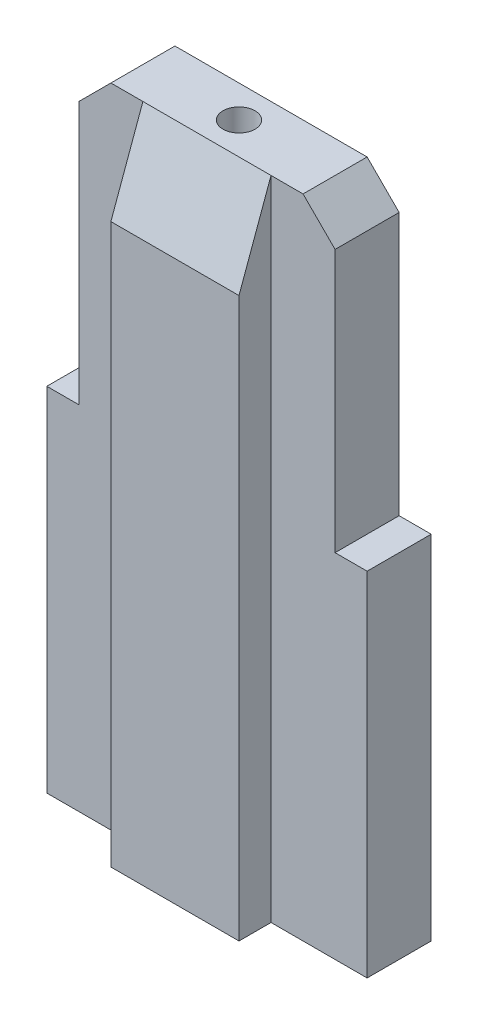
ISO-10303-21;
HEADER;
FILE_DESCRIPTION(('STEP AP214'),'2;1');
FILE_NAME('part.step','',(''),(''),'','','');
FILE_SCHEMA(('AUTOMOTIVE_DESIGN { 1 0 10303 214 1 1 1 1 }'));
ENDSEC;
DATA;
#1=APPLICATION_CONTEXT('core data for automotive mechanical design processes');
#2=APPLICATION_PROTOCOL_DEFINITION('international standard','automotive_design',2000,#1);
#3=PRODUCT_CONTEXT('',#1,'mechanical');
#4=PRODUCT('Part','Part','',(#3));
#5=PRODUCT_RELATED_PRODUCT_CATEGORY('part','',(#4));
#6=PRODUCT_DEFINITION_FORMATION('','',#4);
#7=PRODUCT_DEFINITION_CONTEXT('part definition',#1,'design');
#8=PRODUCT_DEFINITION('design','',#6,#7);
#9=PRODUCT_DEFINITION_SHAPE('','',#8);
#10=(LENGTH_UNIT() NAMED_UNIT(*) SI_UNIT(.MILLI.,.METRE.));
#11=(NAMED_UNIT(*) PLANE_ANGLE_UNIT() SI_UNIT($,.RADIAN.));
#12=(NAMED_UNIT(*) SI_UNIT($,.STERADIAN.) SOLID_ANGLE_UNIT());
#13=UNCERTAINTY_MEASURE_WITH_UNIT(LENGTH_MEASURE(1.E-05),#10,'distance_accuracy_value','');
#14=(GEOMETRIC_REPRESENTATION_CONTEXT(3) GLOBAL_UNCERTAINTY_ASSIGNED_CONTEXT((#13)) GLOBAL_UNIT_ASSIGNED_CONTEXT((#10,
#11,#12)) REPRESENTATION_CONTEXT('',''));
#15=CARTESIAN_POINT('',(0.,0.,0.));
#16=DIRECTION('',(0.,0.,1.));
#17=DIRECTION('',(1.,0.,0.));
#18=AXIS2_PLACEMENT_3D('',#15,#16,#17);
#19=CARTESIAN_POINT('',(0.,0.,-0.5));
#20=DIRECTION('',(0.,0.,1.));
#21=DIRECTION('',(1.,0.,0.));
#22=AXIS2_PLACEMENT_3D('',#19,#20,#21);
#23=PLANE('',#22);
#24=DIRECTION('',(0.,-1.,0.));
#25=VECTOR('',#24,1.);
#26=CARTESIAN_POINT('',(-2.,2.75,-0.5));
#27=LINE('',#26,#25);
#28=CARTESIAN_POINT('',(-2.,6.85,-0.5));
#29=VERTEX_POINT('',#28);
#30=CARTESIAN_POINT('',(-2.,2.75,-0.5));
#31=VERTEX_POINT('',#30);
#32=EDGE_CURVE('E268',#29,#31,#27,.T.);
#33=ORIENTED_EDGE('',*,*,#32,.F.);
#34=DIRECTION('',(-0.707106781186549,-0.707106781186546,0.));
#35=VECTOR('',#34,1.);
#36=CARTESIAN_POINT('',(-2.,6.85,-0.5));
#37=LINE('',#36,#35);
#38=CARTESIAN_POINT('',(-1.49999999999999,7.35,-0.5));
#39=VERTEX_POINT('',#38);
#40=EDGE_CURVE('E219',#29,#39,#37,.F.);
#41=ORIENTED_EDGE('',*,*,#40,.T.);
#42=DIRECTION('',(-1.,0.,0.));
#43=VECTOR('',#42,1.);
#44=CARTESIAN_POINT('',(-2.,7.35,-0.5));
#45=LINE('',#44,#43);
#46=CARTESIAN_POINT('',(-1.,7.35,-0.5));
#47=VERTEX_POINT('',#46);
#48=EDGE_CURVE('E265',#47,#39,#45,.T.);
#49=ORIENTED_EDGE('',*,*,#48,.F.);
#50=DIRECTION('',(0.,1.,0.));
#51=VECTOR('',#50,1.);
#52=CARTESIAN_POINT('',(-1.,7.35,-0.5));
#53=LINE('',#52,#51);
#54=CARTESIAN_POINT('',(-1.,-2.75,-0.5));
#55=VERTEX_POINT('',#54);
#56=EDGE_CURVE('E195',#55,#47,#53,.T.);
#57=ORIENTED_EDGE('',*,*,#56,.F.);
#58=DIRECTION('',(1.,0.,0.));
#59=VECTOR('',#58,1.);
#60=CARTESIAN_POINT('',(-2.5,-2.75,-0.5));
#61=LINE('',#60,#59);
#62=CARTESIAN_POINT('',(-2.5,-2.75,-0.5));
#63=VERTEX_POINT('',#62);
#64=EDGE_CURVE('E382',#63,#55,#61,.T.);
#65=ORIENTED_EDGE('',*,*,#64,.F.);
#66=DIRECTION('',(0.,-1.,0.));
#67=VECTOR('',#66,1.);
#68=CARTESIAN_POINT('',(-2.5,2.75,-0.5));
#69=LINE('',#68,#67);
#70=CARTESIAN_POINT('',(-2.5,2.75,-0.5));
#71=VERTEX_POINT('',#70);
#72=EDGE_CURVE('E419',#71,#63,#69,.T.);
#73=ORIENTED_EDGE('',*,*,#72,.F.);
#74=DIRECTION('',(-1.,0.,0.));
#75=VECTOR('',#74,1.);
#76=CARTESIAN_POINT('',(-2.5,2.75,-0.5));
#77=LINE('',#76,#75);
#78=EDGE_CURVE('E438',#31,#71,#77,.T.);
#79=ORIENTED_EDGE('',*,*,#78,.F.);
#80=EDGE_LOOP('',(#33,#41,#49,#57,#65,#73,#79));
#81=FACE_BOUND('',#80,.T.);
#82=ADVANCED_FACE('F33',(#81),#23,.F.);
#83=CARTESIAN_POINT('',(1.5,7.35,-0.5));
#84=VERTEX_POINT('',#83);
#85=CARTESIAN_POINT('',(0.999999999999999,7.35,-0.5));
#86=VERTEX_POINT('',#85);
#87=EDGE_CURVE('E231',#84,#86,#45,.T.);
#88=ORIENTED_EDGE('',*,*,#87,.F.);
#89=DIRECTION('',(-0.707106781186546,0.707106781186549,0.));
#90=VECTOR('',#89,1.);
#91=CARTESIAN_POINT('',(1.5,7.35,-0.5));
#92=LINE('',#91,#90);
#93=CARTESIAN_POINT('',(2.,6.85,-0.5));
#94=VERTEX_POINT('',#93);
#95=EDGE_CURVE('E56',#84,#94,#92,.F.);
#96=ORIENTED_EDGE('',*,*,#95,.T.);
#97=DIRECTION('',(0.,1.,0.));
#98=VECTOR('',#97,1.);
#99=CARTESIAN_POINT('',(2.,7.35,-0.5));
#100=LINE('',#99,#98);
#101=CARTESIAN_POINT('',(2.,2.75,-0.5));
#102=VERTEX_POINT('',#101);
#103=EDGE_CURVE('E264',#102,#94,#100,.T.);
#104=ORIENTED_EDGE('',*,*,#103,.F.);
#105=DIRECTION('',(-1.,0.,0.));
#106=VECTOR('',#105,1.);
#107=CARTESIAN_POINT('',(2.,2.75,-0.5));
#108=LINE('',#107,#106);
#109=CARTESIAN_POINT('',(2.5,2.75,-0.5));
#110=VERTEX_POINT('',#109);
#111=EDGE_CURVE('E261',#110,#102,#108,.T.);
#112=ORIENTED_EDGE('',*,*,#111,.F.);
#113=DIRECTION('',(0.,1.,0.));
#114=VECTOR('',#113,1.);
#115=CARTESIAN_POINT('',(2.5,2.75,-0.5));
#116=LINE('',#115,#114);
#117=CARTESIAN_POINT('',(2.5,-2.75,-0.5));
#118=VERTEX_POINT('',#117);
#119=EDGE_CURVE('E257',#118,#110,#116,.T.);
#120=ORIENTED_EDGE('',*,*,#119,.F.);
#121=CARTESIAN_POINT('',(0.999999999999999,-2.75,-0.5));
#122=VERTEX_POINT('',#121);
#123=EDGE_CURVE('E275',#122,#118,#61,.T.);
#124=ORIENTED_EDGE('',*,*,#123,.F.);
#125=DIRECTION('',(0.,-1.,0.));
#126=VECTOR('',#125,1.);
#127=CARTESIAN_POINT('',(1.,7.35,-0.5));
#128=LINE('',#127,#126);
#129=EDGE_CURVE('E177',#86,#122,#128,.T.);
#130=ORIENTED_EDGE('',*,*,#129,.F.);
#131=EDGE_LOOP('',(#88,#96,#104,#112,#120,#124,#130));
#132=FACE_BOUND('',#131,.T.);
#133=ADVANCED_FACE('F297',(#132),#23,.F.);
#134=CARTESIAN_POINT('',(0.,0.,0.5));
#135=DIRECTION('',(0.,0.,1.));
#136=DIRECTION('',(1.,0.,0.));
#137=AXIS2_PLACEMENT_3D('',#134,#135,#136);
#138=PLANE('',#137);
#139=DIRECTION('',(0.,1.,0.));
#140=VECTOR('',#139,1.);
#141=CARTESIAN_POINT('',(2.,7.35,0.5));
#142=LINE('',#141,#140);
#143=CARTESIAN_POINT('',(2.,2.75,0.5));
#144=VERTEX_POINT('',#143);
#145=CARTESIAN_POINT('',(2.,6.85,0.5));
#146=VERTEX_POINT('',#145);
#147=EDGE_CURVE('E237',#144,#146,#142,.T.);
#148=ORIENTED_EDGE('',*,*,#147,.T.);
#149=DIRECTION('',(0.707106781186546,-0.707106781186549,0.));
#150=VECTOR('',#149,1.);
#151=CARTESIAN_POINT('',(4.425,4.42499999999999,0.5));
#152=LINE('',#151,#150);
#153=CARTESIAN_POINT('',(1.5,7.35,0.5));
#154=VERTEX_POINT('',#153);
#155=EDGE_CURVE('E11',#146,#154,#152,.F.);
#156=ORIENTED_EDGE('',*,*,#155,.T.);
#157=DIRECTION('',(-1.,0.,0.));
#158=VECTOR('',#157,1.);
#159=CARTESIAN_POINT('',(-2.,7.35,0.5));
#160=LINE('',#159,#158);
#161=CARTESIAN_POINT('',(1.,7.35,0.5));
#162=VERTEX_POINT('',#161);
#163=EDGE_CURVE('E226',#154,#162,#160,.T.);
#164=ORIENTED_EDGE('',*,*,#163,.T.);
#165=DIRECTION('',(0.,1.,0.));
#166=VECTOR('',#165,1.);
#167=CARTESIAN_POINT('',(1.,7.35,0.5));
#168=LINE('',#167,#166);
#169=CARTESIAN_POINT('',(1.,-2.75,0.5));
#170=VERTEX_POINT('',#169);
#171=EDGE_CURVE('E179',#170,#162,#168,.T.);
#172=ORIENTED_EDGE('',*,*,#171,.F.);
#173=DIRECTION('',(1.,0.,0.));
#174=VECTOR('',#173,1.);
#175=CARTESIAN_POINT('',(-2.5,-2.75,0.5));
#176=LINE('',#175,#174);
#177=CARTESIAN_POINT('',(2.5,-2.75,0.5));
#178=VERTEX_POINT('',#177);
#179=EDGE_CURVE('E251',#170,#178,#176,.T.);
#180=ORIENTED_EDGE('',*,*,#179,.T.);
#181=DIRECTION('',(0.,1.,0.));
#182=VECTOR('',#181,1.);
#183=CARTESIAN_POINT('',(2.5,2.75,0.5));
#184=LINE('',#183,#182);
#185=CARTESIAN_POINT('',(2.5,2.75,0.5));
#186=VERTEX_POINT('',#185);
#187=EDGE_CURVE('E371',#178,#186,#184,.T.);
#188=ORIENTED_EDGE('',*,*,#187,.T.);
#189=DIRECTION('',(-1.,0.,0.));
#190=VECTOR('',#189,1.);
#191=CARTESIAN_POINT('',(2.,2.75,0.5));
#192=LINE('',#191,#190);
#193=EDGE_CURVE('E381',#186,#144,#192,.T.);
#194=ORIENTED_EDGE('',*,*,#193,.T.);
#195=EDGE_LOOP('',(#148,#156,#164,#172,#180,#188,#194));
#196=FACE_BOUND('',#195,.T.);
#197=ADVANCED_FACE('F303',(#196),#138,.T.);
#198=CARTESIAN_POINT('',(2.5,2.75,0.5));
#199=DIRECTION('',(-1.,0.,0.));
#200=DIRECTION('',(0.,-1.,0.));
#201=AXIS2_PLACEMENT_3D('',#198,#199,#200);
#202=PLANE('',#201);
#203=ORIENTED_EDGE('',*,*,#119,.T.);
#204=DIRECTION('',(0.,0.,-1.));
#205=VECTOR('',#204,1.);
#206=CARTESIAN_POINT('',(2.5,2.75,0.5));
#207=LINE('',#206,#205);
#208=EDGE_CURVE('E245',#186,#110,#207,.T.);
#209=ORIENTED_EDGE('',*,*,#208,.F.);
#210=ORIENTED_EDGE('',*,*,#187,.F.);
#211=DIRECTION('',(0.,0.,-1.));
#212=VECTOR('',#211,1.);
#213=CARTESIAN_POINT('',(2.5,-2.75,0.5));
#214=LINE('',#213,#212);
#215=EDGE_CURVE('E250',#178,#118,#214,.T.);
#216=ORIENTED_EDGE('',*,*,#215,.T.);
#217=EDGE_LOOP('',(#203,#209,#210,#216));
#218=FACE_BOUND('',#217,.T.);
#219=ADVANCED_FACE('F333',(#218),#202,.F.);
#220=CARTESIAN_POINT('',(2.,2.75,0.5));
#221=DIRECTION('',(0.,-1.,0.));
#222=DIRECTION('',(0.,0.,-1.));
#223=AXIS2_PLACEMENT_3D('',#220,#221,#222);
#224=PLANE('',#223);
#225=ORIENTED_EDGE('',*,*,#111,.T.);
#226=DIRECTION('',(0.,0.,-1.));
#227=VECTOR('',#226,1.);
#228=CARTESIAN_POINT('',(2.,2.75,0.5));
#229=LINE('',#228,#227);
#230=EDGE_CURVE('E427',#144,#102,#229,.T.);
#231=ORIENTED_EDGE('',*,*,#230,.F.);
#232=ORIENTED_EDGE('',*,*,#193,.F.);
#233=ORIENTED_EDGE('',*,*,#208,.T.);
#234=EDGE_LOOP('',(#225,#231,#232,#233));
#235=FACE_BOUND('',#234,.T.);
#236=ADVANCED_FACE('F330',(#235),#224,.F.);
#237=CARTESIAN_POINT('',(2.,7.35,0.5));
#238=DIRECTION('',(-1.,0.,0.));
#239=DIRECTION('',(0.,-1.,0.));
#240=AXIS2_PLACEMENT_3D('',#237,#238,#239);
#241=PLANE('',#240);
#242=ORIENTED_EDGE('',*,*,#103,.T.);
#243=DIRECTION('',(0.,0.,1.));
#244=VECTOR('',#243,1.);
#245=CARTESIAN_POINT('',(2.,6.85,0.5));
#246=LINE('',#245,#244);
#247=EDGE_CURVE('E42',#94,#146,#246,.T.);
#248=ORIENTED_EDGE('',*,*,#247,.T.);
#249=ORIENTED_EDGE('',*,*,#147,.F.);
#250=ORIENTED_EDGE('',*,*,#230,.T.);
#251=EDGE_LOOP('',(#242,#248,#249,#250));
#252=FACE_BOUND('',#251,.T.);
#253=ADVANCED_FACE('F326',(#252),#241,.F.);
#254=CARTESIAN_POINT('',(-2.,7.35,0.5));
#255=DIRECTION('',(0.,-1.,0.));
#256=DIRECTION('',(0.,0.,-1.));
#257=AXIS2_PLACEMENT_3D('',#254,#255,#256);
#258=PLANE('',#257);
#259=CARTESIAN_POINT('',(0.,7.35,0.));
#260=DIRECTION('',(0.,1.,0.));
#261=DIRECTION('',(0.,0.,1.));
#262=AXIS2_PLACEMENT_3D('',#259,#260,#261);
#263=CIRCLE('',#262,0.25);
#264=CARTESIAN_POINT('',(0.,7.35,0.25));
#265=VERTEX_POINT('',#264);
#266=EDGE_CURVE('E279',#265,#265,#263,.T.);
#267=ORIENTED_EDGE('',*,*,#266,.F.);
#268=EDGE_LOOP('',(#267));
#269=FACE_BOUND('',#268,.T.);
#270=ORIENTED_EDGE('',*,*,#163,.F.);
#271=DIRECTION('',(0.,0.,-1.));
#272=VECTOR('',#271,1.);
#273=CARTESIAN_POINT('',(1.5,7.35,0.5));
#274=LINE('',#273,#272);
#275=EDGE_CURVE('E225',#154,#84,#274,.T.);
#276=ORIENTED_EDGE('',*,*,#275,.T.);
#277=ORIENTED_EDGE('',*,*,#87,.T.);
#278=DIRECTION('',(-1.,0.,0.));
#279=VECTOR('',#278,1.);
#280=CARTESIAN_POINT('',(-1.,7.35,-0.5));
#281=LINE('',#280,#279);
#282=EDGE_CURVE('E206',#86,#47,#281,.T.);
#283=ORIENTED_EDGE('',*,*,#282,.T.);
#284=ORIENTED_EDGE('',*,*,#48,.T.);
#285=DIRECTION('',(0.,0.,1.));
#286=VECTOR('',#285,1.);
#287=CARTESIAN_POINT('',(-1.49999999999999,7.35,0.5));
#288=LINE('',#287,#286);
#289=CARTESIAN_POINT('',(-1.49999999999999,7.35,0.5));
#290=VERTEX_POINT('',#289);
#291=EDGE_CURVE('E221',#39,#290,#288,.T.);
#292=ORIENTED_EDGE('',*,*,#291,.T.);
#293=CARTESIAN_POINT('',(-0.999999999999999,7.35,0.5));
#294=VERTEX_POINT('',#293);
#295=EDGE_CURVE('E230',#294,#290,#160,.T.);
#296=ORIENTED_EDGE('',*,*,#295,.F.);
#297=DIRECTION('',(1.,0.,0.));
#298=VECTOR('',#297,1.);
#299=CARTESIAN_POINT('',(1.,7.35,0.5));
#300=LINE('',#299,#298);
#301=EDGE_CURVE('E408',#294,#162,#300,.T.);
#302=ORIENTED_EDGE('',*,*,#301,.T.);
#303=EDGE_LOOP('',(#270,#276,#277,#283,#284,#292,#296,#302));
#304=FACE_BOUND('',#303,.T.);
#305=ADVANCED_FACE('F322',(#269,#304),#258,.F.);
#306=CARTESIAN_POINT('',(-2.,2.75,0.5));
#307=DIRECTION('',(1.,0.,0.));
#308=DIRECTION('',(0.,0.,-1.));
#309=AXIS2_PLACEMENT_3D('',#306,#307,#308);
#310=PLANE('',#309);
#311=DIRECTION('',(0.,-1.,0.));
#312=VECTOR('',#311,1.);
#313=CARTESIAN_POINT('',(-2.,2.75,0.5));
#314=LINE('',#313,#312);
#315=CARTESIAN_POINT('',(-2.,6.85,0.5));
#316=VERTEX_POINT('',#315);
#317=CARTESIAN_POINT('',(-2.,2.75,0.5));
#318=VERTEX_POINT('',#317);
#319=EDGE_CURVE('E229',#316,#318,#314,.T.);
#320=ORIENTED_EDGE('',*,*,#319,.F.);
#321=DIRECTION('',(0.,0.,-1.));
#322=VECTOR('',#321,1.);
#323=CARTESIAN_POINT('',(-2.,6.85,0.5));
#324=LINE('',#323,#322);
#325=EDGE_CURVE('E214',#316,#29,#324,.T.);
#326=ORIENTED_EDGE('',*,*,#325,.T.);
#327=ORIENTED_EDGE('',*,*,#32,.T.);
#328=DIRECTION('',(0.,0.,-1.));
#329=VECTOR('',#328,1.);
#330=CARTESIAN_POINT('',(-2.,2.75,0.5));
#331=LINE('',#330,#329);
#332=EDGE_CURVE('E360',#318,#31,#331,.T.);
#333=ORIENTED_EDGE('',*,*,#332,.F.);
#334=EDGE_LOOP('',(#320,#326,#327,#333));
#335=FACE_BOUND('',#334,.T.);
#336=ADVANCED_FACE('F318',(#335),#310,.F.);
#337=CARTESIAN_POINT('',(-2.5,2.75,0.5));
#338=DIRECTION('',(0.,-1.,0.));
#339=DIRECTION('',(0.,0.,-1.));
#340=AXIS2_PLACEMENT_3D('',#337,#338,#339);
#341=PLANE('',#340);
#342=ORIENTED_EDGE('',*,*,#78,.T.);
#343=DIRECTION('',(0.,0.,-1.));
#344=VECTOR('',#343,1.);
#345=CARTESIAN_POINT('',(-2.5,2.75,0.5));
#346=LINE('',#345,#344);
#347=CARTESIAN_POINT('',(-2.5,2.75,0.5));
#348=VERTEX_POINT('',#347);
#349=EDGE_CURVE('E424',#348,#71,#346,.T.);
#350=ORIENTED_EDGE('',*,*,#349,.F.);
#351=DIRECTION('',(-1.,0.,0.));
#352=VECTOR('',#351,1.);
#353=CARTESIAN_POINT('',(-2.5,2.75,0.5));
#354=LINE('',#353,#352);
#355=EDGE_CURVE('E362',#318,#348,#354,.T.);
#356=ORIENTED_EDGE('',*,*,#355,.F.);
#357=ORIENTED_EDGE('',*,*,#332,.T.);
#358=EDGE_LOOP('',(#342,#350,#356,#357));
#359=FACE_BOUND('',#358,.T.);
#360=ADVANCED_FACE('F314',(#359),#341,.F.);
#361=CARTESIAN_POINT('',(-2.5,2.75,0.5));
#362=DIRECTION('',(1.,0.,0.));
#363=DIRECTION('',(0.,1.,0.));
#364=AXIS2_PLACEMENT_3D('',#361,#362,#363);
#365=PLANE('',#364);
#366=ORIENTED_EDGE('',*,*,#72,.T.);
#367=DIRECTION('',(0.,0.,-1.));
#368=VECTOR('',#367,1.);
#369=CARTESIAN_POINT('',(-2.5,-2.75,0.5));
#370=LINE('',#369,#368);
#371=CARTESIAN_POINT('',(-2.5,-2.75,0.5));
#372=VERTEX_POINT('',#371);
#373=EDGE_CURVE('E378',#372,#63,#370,.T.);
#374=ORIENTED_EDGE('',*,*,#373,.F.);
#375=DIRECTION('',(0.,-1.,0.));
#376=VECTOR('',#375,1.);
#377=CARTESIAN_POINT('',(-2.5,2.75,0.5));
#378=LINE('',#377,#376);
#379=EDGE_CURVE('E256',#348,#372,#378,.T.);
#380=ORIENTED_EDGE('',*,*,#379,.F.);
#381=ORIENTED_EDGE('',*,*,#349,.T.);
#382=EDGE_LOOP('',(#366,#374,#380,#381));
#383=FACE_BOUND('',#382,.T.);
#384=ADVANCED_FACE('F311',(#383),#365,.F.);
#385=CARTESIAN_POINT('',(-2.5,-2.75,0.5));
#386=DIRECTION('',(0.,1.,0.));
#387=DIRECTION('',(0.,0.,1.));
#388=AXIS2_PLACEMENT_3D('',#385,#386,#387);
#389=PLANE('',#388);
#390=CARTESIAN_POINT('',(0.,-2.75,0.));
#391=DIRECTION('',(0.,1.,0.));
#392=DIRECTION('',(0.,0.,1.));
#393=AXIS2_PLACEMENT_3D('',#390,#391,#392);
#394=CIRCLE('',#393,0.25);
#395=CARTESIAN_POINT('',(0.,-2.75,0.25));
#396=VERTEX_POINT('',#395);
#397=EDGE_CURVE('E37',#396,#396,#394,.T.);
#398=ORIENTED_EDGE('',*,*,#397,.T.);
#399=EDGE_LOOP('',(#398));
#400=FACE_BOUND('',#399,.T.);
#401=ORIENTED_EDGE('',*,*,#64,.T.);
#402=DIRECTION('',(0.,0.,1.));
#403=VECTOR('',#402,1.);
#404=CARTESIAN_POINT('',(-1.,-2.75,-1.));
#405=LINE('',#404,#403);
#406=CARTESIAN_POINT('',(-1.,-2.75,-1.));
#407=VERTEX_POINT('',#406);
#408=EDGE_CURVE('E180',#407,#55,#405,.T.);
#409=ORIENTED_EDGE('',*,*,#408,.F.);
#410=DIRECTION('',(-1.,0.,0.));
#411=VECTOR('',#410,1.);
#412=CARTESIAN_POINT('',(0.999999999999999,-2.75,-1.));
#413=LINE('',#412,#411);
#414=CARTESIAN_POINT('',(0.999999999999999,-2.75,-1.));
#415=VERTEX_POINT('',#414);
#416=EDGE_CURVE('E164',#415,#407,#413,.T.);
#417=ORIENTED_EDGE('',*,*,#416,.F.);
#418=DIRECTION('',(0.,0.,1.));
#419=VECTOR('',#418,1.);
#420=CARTESIAN_POINT('',(0.999999999999999,-2.75,-1.));
#421=LINE('',#420,#419);
#422=EDGE_CURVE('E174',#415,#122,#421,.T.);
#423=ORIENTED_EDGE('',*,*,#422,.T.);
#424=ORIENTED_EDGE('',*,*,#123,.T.);
#425=ORIENTED_EDGE('',*,*,#215,.F.);
#426=ORIENTED_EDGE('',*,*,#179,.F.);
#427=DIRECTION('',(0.,0.,-1.));
#428=VECTOR('',#427,1.);
#429=CARTESIAN_POINT('',(1.,-2.75,1.));
#430=LINE('',#429,#428);
#431=CARTESIAN_POINT('',(1.,-2.75,1.));
#432=VERTEX_POINT('',#431);
#433=EDGE_CURVE('E395',#432,#170,#430,.T.);
#434=ORIENTED_EDGE('',*,*,#433,.F.);
#435=DIRECTION('',(1.,0.,0.));
#436=VECTOR('',#435,1.);
#437=CARTESIAN_POINT('',(-0.999999999999998,-2.75,1.));
#438=LINE('',#437,#436);
#439=CARTESIAN_POINT('',(-0.999999999999998,-2.75,1.));
#440=VERTEX_POINT('',#439);
#441=EDGE_CURVE('E400',#440,#432,#438,.T.);
#442=ORIENTED_EDGE('',*,*,#441,.F.);
#443=DIRECTION('',(0.,0.,-1.));
#444=VECTOR('',#443,1.);
#445=CARTESIAN_POINT('',(-0.999999999999998,-2.75,1.));
#446=LINE('',#445,#444);
#447=CARTESIAN_POINT('',(-0.999999999999998,-2.75,0.5));
#448=VERTEX_POINT('',#447);
#449=EDGE_CURVE('E262',#440,#448,#446,.T.);
#450=ORIENTED_EDGE('',*,*,#449,.T.);
#451=EDGE_CURVE('E247',#372,#448,#176,.T.);
#452=ORIENTED_EDGE('',*,*,#451,.F.);
#453=ORIENTED_EDGE('',*,*,#373,.T.);
#454=EDGE_LOOP('',(#401,#409,#417,#423,#424,#425,#426,#434,#442,#450,#452,#453));
#455=FACE_BOUND('',#454,.T.);
#456=ADVANCED_FACE('F183',(#400,#455),#389,.F.);
#457=ORIENTED_EDGE('',*,*,#295,.T.);
#458=DIRECTION('',(0.707106781186549,0.707106781186546,0.));
#459=VECTOR('',#458,1.);
#460=CARTESIAN_POINT('',(-4.42499999999999,4.42500000000001,0.5));
#461=LINE('',#460,#459);
#462=EDGE_CURVE('E223',#290,#316,#461,.F.);
#463=ORIENTED_EDGE('',*,*,#462,.T.);
#464=ORIENTED_EDGE('',*,*,#319,.T.);
#465=ORIENTED_EDGE('',*,*,#355,.T.);
#466=ORIENTED_EDGE('',*,*,#379,.T.);
#467=ORIENTED_EDGE('',*,*,#451,.T.);
#468=DIRECTION('',(0.,-1.,0.));
#469=VECTOR('',#468,1.);
#470=CARTESIAN_POINT('',(-0.999999999999999,7.35,0.5));
#471=LINE('',#470,#469);
#472=EDGE_CURVE('E389',#294,#448,#471,.T.);
#473=ORIENTED_EDGE('',*,*,#472,.F.);
#474=EDGE_LOOP('',(#457,#463,#464,#465,#466,#467,#473));
#475=FACE_BOUND('',#474,.T.);
#476=ADVANCED_FACE('F307',(#475),#138,.T.);
#477=CARTESIAN_POINT('',(1.,7.35,1.));
#478=DIRECTION('',(-1.,0.,0.));
#479=DIRECTION('',(0.,-1.,0.));
#480=AXIS2_PLACEMENT_3D('',#477,#478,#479);
#481=PLANE('',#480);
#482=ORIENTED_EDGE('',*,*,#171,.T.);
#483=DIRECTION('',(0.,-0.939692620785908,0.342020143325669));
#484=VECTOR('',#483,1.);
#485=CARTESIAN_POINT('',(1.,5.97626129027269,1.));
#486=LINE('',#485,#484);
#487=CARTESIAN_POINT('',(1.,5.97626129027269,0.999999999999999));
#488=VERTEX_POINT('',#487);
#489=EDGE_CURVE('E204',#162,#488,#486,.T.);
#490=ORIENTED_EDGE('',*,*,#489,.T.);
#491=DIRECTION('',(0.,1.,0.));
#492=VECTOR('',#491,1.);
#493=CARTESIAN_POINT('',(1.,7.35,1.));
#494=LINE('',#493,#492);
#495=EDGE_CURVE('E392',#432,#488,#494,.T.);
#496=ORIENTED_EDGE('',*,*,#495,.F.);
#497=ORIENTED_EDGE('',*,*,#433,.T.);
#498=EDGE_LOOP('',(#482,#490,#496,#497));
#499=FACE_BOUND('',#498,.T.);
#500=ADVANCED_FACE('F452',(#499),#481,.F.);
#501=CARTESIAN_POINT('',(-0.999999999999999,7.35,1.));
#502=DIRECTION('',(1.,0.,0.));
#503=DIRECTION('',(0.,1.,0.));
#504=AXIS2_PLACEMENT_3D('',#501,#502,#503);
#505=PLANE('',#504);
#506=DIRECTION('',(0.,-1.,0.));
#507=VECTOR('',#506,1.);
#508=CARTESIAN_POINT('',(-0.999999999999999,7.35,1.));
#509=LINE('',#508,#507);
#510=CARTESIAN_POINT('',(-0.999999999999999,5.97626129027269,0.999999999999999));
#511=VERTEX_POINT('',#510);
#512=EDGE_CURVE('E456',#511,#440,#509,.T.);
#513=ORIENTED_EDGE('',*,*,#512,.F.);
#514=DIRECTION('',(0.,0.939692620785908,-0.342020143325669));
#515=VECTOR('',#514,1.);
#516=CARTESIAN_POINT('',(-0.999999999999999,5.97626129027269,1.));
#517=LINE('',#516,#515);
#518=EDGE_CURVE('E406',#511,#294,#517,.T.);
#519=ORIENTED_EDGE('',*,*,#518,.T.);
#520=ORIENTED_EDGE('',*,*,#472,.T.);
#521=ORIENTED_EDGE('',*,*,#449,.F.);
#522=EDGE_LOOP('',(#513,#519,#520,#521));
#523=FACE_BOUND('',#522,.T.);
#524=ADVANCED_FACE('F460',(#523),#505,.F.);
#525=CARTESIAN_POINT('',(0.,0.,1.));
#526=DIRECTION('',(0.,0.,1.));
#527=DIRECTION('',(1.,0.,0.));
#528=AXIS2_PLACEMENT_3D('',#525,#526,#527);
#529=PLANE('',#528);
#530=ORIENTED_EDGE('',*,*,#495,.T.);
#531=DIRECTION('',(-1.,0.,0.));
#532=VECTOR('',#531,1.);
#533=CARTESIAN_POINT('',(-0.999999999999999,5.97626129027269,1.));
#534=LINE('',#533,#532);
#535=EDGE_CURVE('E403',#488,#511,#534,.T.);
#536=ORIENTED_EDGE('',*,*,#535,.T.);
#537=ORIENTED_EDGE('',*,*,#512,.T.);
#538=ORIENTED_EDGE('',*,*,#441,.T.);
#539=EDGE_LOOP('',(#530,#536,#537,#538));
#540=FACE_BOUND('',#539,.T.);
#541=ADVANCED_FACE('F342',(#540),#529,.T.);
#542=CARTESIAN_POINT('',(0.,5.97626129027269,1.));
#543=DIRECTION('',(0.,0.342020143325669,0.939692620785908));
#544=DIRECTION('',(1.,0.,0.));
#545=AXIS2_PLACEMENT_3D('',#542,#543,#544);
#546=PLANE('',#545);
#547=ORIENTED_EDGE('',*,*,#489,.F.);
#548=ORIENTED_EDGE('',*,*,#301,.F.);
#549=ORIENTED_EDGE('',*,*,#518,.F.);
#550=ORIENTED_EDGE('',*,*,#535,.F.);
#551=EDGE_LOOP('',(#547,#548,#549,#550));
#552=FACE_BOUND('',#551,.T.);
#553=ADVANCED_FACE('F338',(#552),#546,.T.);
#554=CARTESIAN_POINT('',(-1.,7.35,-1.));
#555=DIRECTION('',(1.,0.,0.));
#556=DIRECTION('',(0.,1.,0.));
#557=AXIS2_PLACEMENT_3D('',#554,#555,#556);
#558=PLANE('',#557);
#559=ORIENTED_EDGE('',*,*,#56,.T.);
#560=DIRECTION('',(0.,-0.939692620785908,-0.342020143325669));
#561=VECTOR('',#560,1.);
#562=CARTESIAN_POINT('',(-1.,5.97626129027269,-1.));
#563=LINE('',#562,#561);
#564=CARTESIAN_POINT('',(-1.,5.97626129027269,-0.999999999999999));
#565=VERTEX_POINT('',#564);
#566=EDGE_CURVE('E210',#47,#565,#563,.T.);
#567=ORIENTED_EDGE('',*,*,#566,.T.);
#568=DIRECTION('',(0.,1.,0.));
#569=VECTOR('',#568,1.);
#570=CARTESIAN_POINT('',(-1.,7.35,-1.));
#571=LINE('',#570,#569);
#572=EDGE_CURVE('E170',#407,#565,#571,.T.);
#573=ORIENTED_EDGE('',*,*,#572,.F.);
#574=ORIENTED_EDGE('',*,*,#408,.T.);
#575=EDGE_LOOP('',(#559,#567,#573,#574));
#576=FACE_BOUND('',#575,.T.);
#577=ADVANCED_FACE('F341',(#576),#558,.F.);
#578=CARTESIAN_POINT('',(1.,7.35,-1.));
#579=DIRECTION('',(-1.,0.,0.));
#580=DIRECTION('',(0.,-1.,0.));
#581=AXIS2_PLACEMENT_3D('',#578,#579,#580);
#582=PLANE('',#581);
#583=DIRECTION('',(0.,-1.,0.));
#584=VECTOR('',#583,1.);
#585=CARTESIAN_POINT('',(1.,7.35,-1.));
#586=LINE('',#585,#584);
#587=CARTESIAN_POINT('',(0.999999999999999,5.97626129027269,-0.999999999999999));
#588=VERTEX_POINT('',#587);
#589=EDGE_CURVE('E159',#588,#415,#586,.T.);
#590=ORIENTED_EDGE('',*,*,#589,.F.);
#591=DIRECTION('',(0.,0.939692620785908,0.342020143325669));
#592=VECTOR('',#591,1.);
#593=CARTESIAN_POINT('',(0.999999999999999,5.97626129027269,-1.));
#594=LINE('',#593,#592);
#595=EDGE_CURVE('E203',#588,#86,#594,.T.);
#596=ORIENTED_EDGE('',*,*,#595,.T.);
#597=ORIENTED_EDGE('',*,*,#129,.T.);
#598=ORIENTED_EDGE('',*,*,#422,.F.);
#599=EDGE_LOOP('',(#590,#596,#597,#598));
#600=FACE_BOUND('',#599,.T.);
#601=ADVANCED_FACE('F175',(#600),#582,.F.);
#602=CARTESIAN_POINT('',(0.,0.,-1.));
#603=DIRECTION('',(0.,0.,-1.));
#604=DIRECTION('',(-1.,0.,0.));
#605=AXIS2_PLACEMENT_3D('',#602,#603,#604);
#606=PLANE('',#605);
#607=ORIENTED_EDGE('',*,*,#572,.T.);
#608=DIRECTION('',(1.,0.,0.));
#609=VECTOR('',#608,1.);
#610=CARTESIAN_POINT('',(1.,5.97626129027269,-1.));
#611=LINE('',#610,#609);
#612=EDGE_CURVE('E167',#565,#588,#611,.T.);
#613=ORIENTED_EDGE('',*,*,#612,.T.);
#614=ORIENTED_EDGE('',*,*,#589,.T.);
#615=ORIENTED_EDGE('',*,*,#416,.T.);
#616=EDGE_LOOP('',(#607,#613,#614,#615));
#617=FACE_BOUND('',#616,.T.);
#618=ADVANCED_FACE('F162',(#617),#606,.T.);
#619=CARTESIAN_POINT('',(0.,5.97626129027269,-1.));
#620=DIRECTION('',(0.,0.342020143325669,-0.939692620785908));
#621=DIRECTION('',(-1.,0.,0.));
#622=AXIS2_PLACEMENT_3D('',#619,#620,#621);
#623=PLANE('',#622);
#624=ORIENTED_EDGE('',*,*,#566,.F.);
#625=ORIENTED_EDGE('',*,*,#282,.F.);
#626=ORIENTED_EDGE('',*,*,#595,.F.);
#627=ORIENTED_EDGE('',*,*,#612,.F.);
#628=EDGE_LOOP('',(#624,#625,#626,#627));
#629=FACE_BOUND('',#628,.T.);
#630=ADVANCED_FACE('F344',(#629),#623,.T.);
#631=CARTESIAN_POINT('',(-2.,6.85,0.5));
#632=DIRECTION('',(0.707106781186546,-0.707106781186549,0.));
#633=DIRECTION('',(0.,0.,-1.));
#634=AXIS2_PLACEMENT_3D('',#631,#632,#633);
#635=PLANE('',#634);
#636=ORIENTED_EDGE('',*,*,#462,.F.);
#637=ORIENTED_EDGE('',*,*,#291,.F.);
#638=ORIENTED_EDGE('',*,*,#40,.F.);
#639=ORIENTED_EDGE('',*,*,#325,.F.);
#640=EDGE_LOOP('',(#636,#637,#638,#639));
#641=FACE_BOUND('',#640,.T.);
#642=ADVANCED_FACE('F293',(#641),#635,.F.);
#643=CARTESIAN_POINT('',(1.5,7.35,0.5));
#644=DIRECTION('',(-0.707106781186549,-0.707106781186546,0.));
#645=DIRECTION('',(0.,0.,-1.));
#646=AXIS2_PLACEMENT_3D('',#643,#644,#645);
#647=PLANE('',#646);
#648=ORIENTED_EDGE('',*,*,#155,.F.);
#649=ORIENTED_EDGE('',*,*,#247,.F.);
#650=ORIENTED_EDGE('',*,*,#95,.F.);
#651=ORIENTED_EDGE('',*,*,#275,.F.);
#652=EDGE_LOOP('',(#648,#649,#650,#651));
#653=FACE_BOUND('',#652,.T.);
#654=ADVANCED_FACE('F35',(#653),#647,.F.);
#655=CARTESIAN_POINT('',(0.,-2.75005,0.));
#656=DIRECTION('',(0.,1.,0.));
#657=DIRECTION('',(0.,0.,1.));
#658=AXIS2_PLACEMENT_3D('',#655,#656,#657);
#659=CYLINDRICAL_SURFACE('',#658,0.25);
#660=ORIENTED_EDGE('',*,*,#266,.T.);
#661=EDGE_LOOP('',(#660));
#662=FACE_BOUND('',#661,.T.);
#663=ORIENTED_EDGE('',*,*,#397,.F.);
#664=EDGE_LOOP('',(#663));
#665=FACE_BOUND('',#664,.T.);
#666=ADVANCED_FACE('F287',(#662,#665),#659,.F.);
#667=CLOSED_SHELL('',(#82,#133,#197,#219,#236,#253,#305,#336,#360,#384,#456,#476,#500,#524,#541,
#553,#577,#601,#618,#630,#642,#654,#666));
#668=MANIFOLD_SOLID_BREP('B2',#667);
#669=ADVANCED_BREP_SHAPE_REPRESENTATION('',(#18,#668),#14);
#670=SHAPE_DEFINITION_REPRESENTATION(#9,#669);
ENDSEC;
END-ISO-10303-21;
